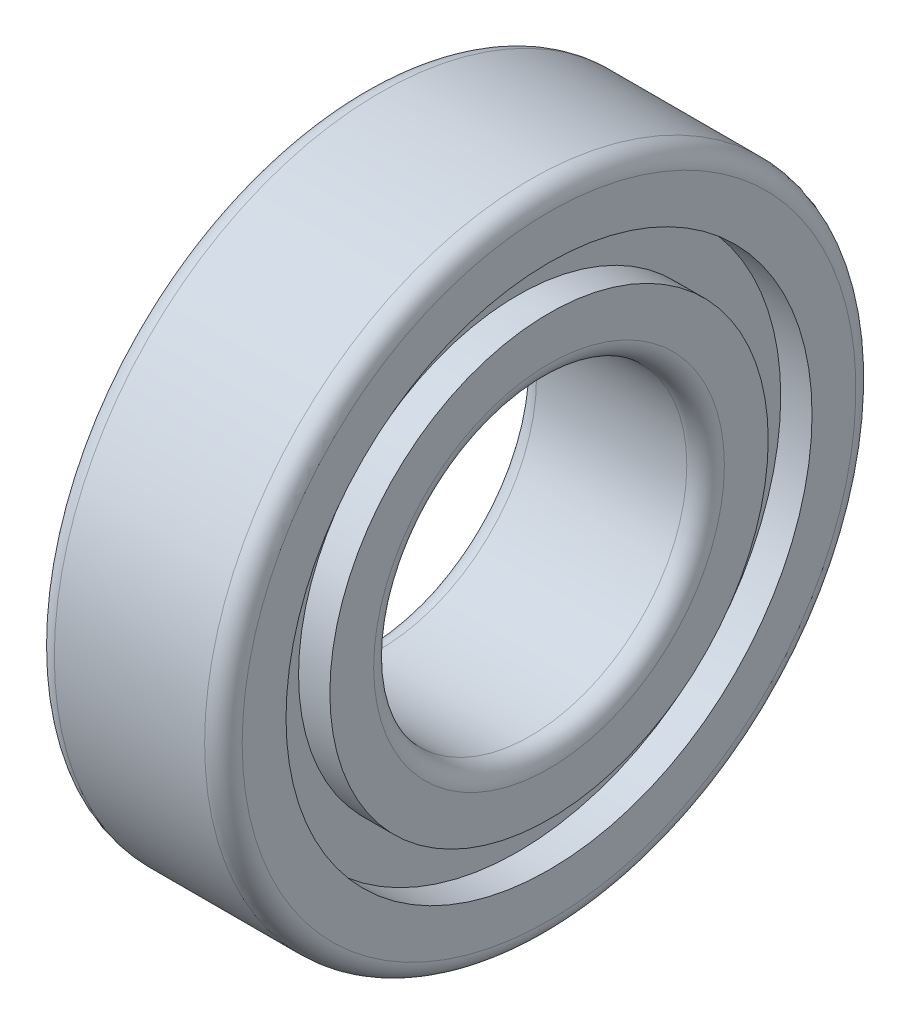
ISO-10303-21;
HEADER;
FILE_DESCRIPTION(('STEP AP214'),'2;1');
FILE_NAME('part.step','',(''),(''),'','','');
FILE_SCHEMA(('AUTOMOTIVE_DESIGN { 1 0 10303 214 1 1 1 1 }'));
ENDSEC;
DATA;
#1=APPLICATION_CONTEXT('core data for automotive mechanical design processes');
#2=APPLICATION_PROTOCOL_DEFINITION('international standard','automotive_design',2000,#1);
#3=PRODUCT_CONTEXT('',#1,'mechanical');
#4=PRODUCT('Part','Part','',(#3));
#5=PRODUCT_RELATED_PRODUCT_CATEGORY('part','',(#4));
#6=PRODUCT_DEFINITION_FORMATION('','',#4);
#7=PRODUCT_DEFINITION_CONTEXT('part definition',#1,'design');
#8=PRODUCT_DEFINITION('design','',#6,#7);
#9=PRODUCT_DEFINITION_SHAPE('','',#8);
#10=(LENGTH_UNIT() NAMED_UNIT(*) SI_UNIT(.MILLI.,.METRE.));
#11=(NAMED_UNIT(*) PLANE_ANGLE_UNIT() SI_UNIT($,.RADIAN.));
#12=(NAMED_UNIT(*) SI_UNIT($,.STERADIAN.) SOLID_ANGLE_UNIT());
#13=UNCERTAINTY_MEASURE_WITH_UNIT(LENGTH_MEASURE(1.E-05),#10,'distance_accuracy_value','');
#14=(GEOMETRIC_REPRESENTATION_CONTEXT(3) GLOBAL_UNCERTAINTY_ASSIGNED_CONTEXT((#13)) GLOBAL_UNIT_ASSIGNED_CONTEXT((#10,
#11,#12)) REPRESENTATION_CONTEXT('',''));
#15=CARTESIAN_POINT('',(0.,0.,0.));
#16=DIRECTION('',(0.,0.,1.));
#17=DIRECTION('',(1.,0.,0.));
#18=AXIS2_PLACEMENT_3D('',#15,#16,#17);
#19=CARTESIAN_POINT('',(-6.,0.,0.));
#20=DIRECTION('',(-1.,0.,0.));
#21=DIRECTION('',(0.,0.,1.));
#22=AXIS2_PLACEMENT_3D('',#19,#20,#21);
#23=TOROIDAL_SURFACE('',#22,14.,1.5);
#24=CARTESIAN_POINT('',(-6.00000000000001,0.,0.));
#25=DIRECTION('',(-1.,0.,0.));
#26=DIRECTION('',(0.,0.,1.));
#27=AXIS2_PLACEMENT_3D('',#24,#25,#26);
#28=CIRCLE('',#27,12.5);
#29=CARTESIAN_POINT('',(-6.00000000000001,0.,12.5));
#30=VERTEX_POINT('',#29);
#31=EDGE_CURVE('E85',#30,#30,#28,.T.);
#32=ORIENTED_EDGE('',*,*,#31,.F.);
#33=EDGE_LOOP('',(#32));
#34=FACE_BOUND('',#33,.T.);
#35=CARTESIAN_POINT('',(-7.49999999999995,0.,0.));
#36=DIRECTION('',(-1.,0.,0.));
#37=DIRECTION('',(0.,0.,1.));
#38=AXIS2_PLACEMENT_3D('',#35,#36,#37);
#39=CIRCLE('',#38,14.);
#40=CARTESIAN_POINT('',(-7.49999999999995,0.,14.));
#41=VERTEX_POINT('',#40);
#42=EDGE_CURVE('E10',#41,#41,#39,.T.);
#43=ORIENTED_EDGE('',*,*,#42,.T.);
#44=EDGE_LOOP('',(#43));
#45=FACE_BOUND('',#44,.T.);
#46=ADVANCED_FACE('F33',(#34,#45),#23,.T.);
#47=CARTESIAN_POINT('',(-7.5,14.,0.));
#48=DIRECTION('',(1.,0.,0.));
#49=DIRECTION('',(0.,0.,-1.));
#50=AXIS2_PLACEMENT_3D('',#47,#48,#49);
#51=PLANE('',#50);
#52=ORIENTED_EDGE('',*,*,#42,.F.);
#53=EDGE_LOOP('',(#52));
#54=FACE_BOUND('',#53,.T.);
#55=CARTESIAN_POINT('',(-7.49999999999995,0.,0.));
#56=DIRECTION('',(-1.,0.,0.));
#57=DIRECTION('',(0.,0.,1.));
#58=AXIS2_PLACEMENT_3D('',#55,#56,#57);
#59=CIRCLE('',#58,17.5);
#60=CARTESIAN_POINT('',(-7.49999999999995,0.,17.5));
#61=VERTEX_POINT('',#60);
#62=EDGE_CURVE('E39',#61,#61,#59,.T.);
#63=ORIENTED_EDGE('',*,*,#62,.T.);
#64=EDGE_LOOP('',(#63));
#65=FACE_BOUND('',#64,.T.);
#66=ADVANCED_FACE('F92',(#54,#65),#51,.F.);
#67=CARTESIAN_POINT('',(-1000.,0.,0.));
#68=DIRECTION('',(-1.,0.,0.));
#69=DIRECTION('',(0.,0.,1.));
#70=AXIS2_PLACEMENT_3D('',#67,#68,#69);
#71=CYLINDRICAL_SURFACE('',#70,17.5);
#72=ORIENTED_EDGE('',*,*,#62,.F.);
#73=EDGE_LOOP('',(#72));
#74=FACE_BOUND('',#73,.T.);
#75=CARTESIAN_POINT('',(-5.,0.,0.));
#76=DIRECTION('',(-1.,0.,0.));
#77=DIRECTION('',(0.,0.,1.));
#78=AXIS2_PLACEMENT_3D('',#75,#76,#77);
#79=CIRCLE('',#78,17.5);
#80=CARTESIAN_POINT('',(-5.,0.,17.5));
#81=VERTEX_POINT('',#80);
#82=EDGE_CURVE('E43',#81,#81,#79,.T.);
#83=ORIENTED_EDGE('',*,*,#82,.T.);
#84=EDGE_LOOP('',(#83));
#85=FACE_BOUND('',#84,.T.);
#86=ADVANCED_FACE('F96',(#74,#85),#71,.T.);
#87=CARTESIAN_POINT('',(-5.,17.5,0.));
#88=DIRECTION('',(1.,0.,0.));
#89=DIRECTION('',(0.,0.,-1.));
#90=AXIS2_PLACEMENT_3D('',#87,#88,#89);
#91=PLANE('',#90);
#92=ORIENTED_EDGE('',*,*,#82,.F.);
#93=EDGE_LOOP('',(#92));
#94=FACE_BOUND('',#93,.T.);
#95=CARTESIAN_POINT('',(-5.,0.,0.));
#96=DIRECTION('',(-1.,0.,0.));
#97=DIRECTION('',(0.,0.,1.));
#98=AXIS2_PLACEMENT_3D('',#95,#96,#97);
#99=CIRCLE('',#98,21.);
#100=CARTESIAN_POINT('',(-5.,0.,21.));
#101=VERTEX_POINT('',#100);
#102=EDGE_CURVE('E47',#101,#101,#99,.T.);
#103=ORIENTED_EDGE('',*,*,#102,.T.);
#104=EDGE_LOOP('',(#103));
#105=FACE_BOUND('',#104,.T.);
#106=ADVANCED_FACE('F101',(#94,#105),#91,.F.);
#107=CARTESIAN_POINT('',(-1000.,0.,0.));
#108=DIRECTION('',(-1.,0.,0.));
#109=DIRECTION('',(0.,0.,1.));
#110=AXIS2_PLACEMENT_3D('',#107,#108,#109);
#111=CYLINDRICAL_SURFACE('',#110,21.);
#112=ORIENTED_EDGE('',*,*,#102,.F.);
#113=EDGE_LOOP('',(#112));
#114=FACE_BOUND('',#113,.T.);
#115=CARTESIAN_POINT('',(-7.49999999999995,0.,0.));
#116=DIRECTION('',(-1.,0.,0.));
#117=DIRECTION('',(0.,0.,1.));
#118=AXIS2_PLACEMENT_3D('',#115,#116,#117);
#119=CIRCLE('',#118,21.);
#120=CARTESIAN_POINT('',(-7.49999999999995,0.,21.));
#121=VERTEX_POINT('',#120);
#122=EDGE_CURVE('E52',#121,#121,#119,.T.);
#123=ORIENTED_EDGE('',*,*,#122,.T.);
#124=EDGE_LOOP('',(#123));
#125=FACE_BOUND('',#124,.T.);
#126=ADVANCED_FACE('F107',(#114,#125),#111,.F.);
#127=CARTESIAN_POINT('',(-7.5,21.,0.));
#128=DIRECTION('',(1.,0.,0.));
#129=DIRECTION('',(0.,0.,-1.));
#130=AXIS2_PLACEMENT_3D('',#127,#128,#129);
#131=PLANE('',#130);
#132=ORIENTED_EDGE('',*,*,#122,.F.);
#133=EDGE_LOOP('',(#132));
#134=FACE_BOUND('',#133,.T.);
#135=CARTESIAN_POINT('',(-7.49999999999995,0.,0.));
#136=DIRECTION('',(-1.,0.,0.));
#137=DIRECTION('',(0.,0.,1.));
#138=AXIS2_PLACEMENT_3D('',#135,#136,#137);
#139=CIRCLE('',#138,24.5);
#140=CARTESIAN_POINT('',(-7.49999999999995,0.,24.5));
#141=VERTEX_POINT('',#140);
#142=EDGE_CURVE('E55',#141,#141,#139,.T.);
#143=ORIENTED_EDGE('',*,*,#142,.T.);
#144=EDGE_LOOP('',(#143));
#145=FACE_BOUND('',#144,.T.);
#146=ADVANCED_FACE('F111',(#134,#145),#131,.F.);
#147=CARTESIAN_POINT('',(-6.,0.,0.));
#148=DIRECTION('',(-1.,0.,0.));
#149=DIRECTION('',(0.,0.,1.));
#150=AXIS2_PLACEMENT_3D('',#147,#148,#149);
#151=TOROIDAL_SURFACE('',#150,24.5,1.5);
#152=ORIENTED_EDGE('',*,*,#142,.F.);
#153=EDGE_LOOP('',(#152));
#154=FACE_BOUND('',#153,.T.);
#155=CARTESIAN_POINT('',(-6.00000000000001,0.,0.));
#156=DIRECTION('',(-1.,0.,0.));
#157=DIRECTION('',(0.,0.,1.));
#158=AXIS2_PLACEMENT_3D('',#155,#156,#157);
#159=CIRCLE('',#158,26.);
#160=CARTESIAN_POINT('',(-6.00000000000001,0.,26.));
#161=VERTEX_POINT('',#160);
#162=EDGE_CURVE('E58',#161,#161,#159,.T.);
#163=ORIENTED_EDGE('',*,*,#162,.T.);
#164=EDGE_LOOP('',(#163));
#165=FACE_BOUND('',#164,.T.);
#166=ADVANCED_FACE('F115',(#154,#165),#151,.T.);
#167=CARTESIAN_POINT('',(-1000.,0.,0.));
#168=DIRECTION('',(-1.,0.,0.));
#169=DIRECTION('',(0.,0.,1.));
#170=AXIS2_PLACEMENT_3D('',#167,#168,#169);
#171=CYLINDRICAL_SURFACE('',#170,26.);
#172=ORIENTED_EDGE('',*,*,#162,.F.);
#173=EDGE_LOOP('',(#172));
#174=FACE_BOUND('',#173,.T.);
#175=CARTESIAN_POINT('',(6.00000000000001,0.,0.));
#176=DIRECTION('',(-1.,0.,0.));
#177=DIRECTION('',(0.,0.,1.));
#178=AXIS2_PLACEMENT_3D('',#175,#176,#177);
#179=CIRCLE('',#178,26.);
#180=CARTESIAN_POINT('',(6.00000000000001,0.,26.));
#181=VERTEX_POINT('',#180);
#182=EDGE_CURVE('E61',#181,#181,#179,.T.);
#183=ORIENTED_EDGE('',*,*,#182,.T.);
#184=EDGE_LOOP('',(#183));
#185=FACE_BOUND('',#184,.T.);
#186=ADVANCED_FACE('F119',(#174,#185),#171,.T.);
#187=CARTESIAN_POINT('',(6.,0.,0.));
#188=DIRECTION('',(-1.,0.,0.));
#189=DIRECTION('',(0.,0.,1.));
#190=AXIS2_PLACEMENT_3D('',#187,#188,#189);
#191=TOROIDAL_SURFACE('',#190,24.5,1.5);
#192=ORIENTED_EDGE('',*,*,#182,.F.);
#193=EDGE_LOOP('',(#192));
#194=FACE_BOUND('',#193,.T.);
#195=CARTESIAN_POINT('',(7.50000000000006,0.,0.));
#196=DIRECTION('',(-1.,0.,0.));
#197=DIRECTION('',(0.,0.,1.));
#198=AXIS2_PLACEMENT_3D('',#195,#196,#197);
#199=CIRCLE('',#198,24.5);
#200=CARTESIAN_POINT('',(7.50000000000006,0.,24.5));
#201=VERTEX_POINT('',#200);
#202=EDGE_CURVE('E64',#201,#201,#199,.T.);
#203=ORIENTED_EDGE('',*,*,#202,.T.);
#204=EDGE_LOOP('',(#203));
#205=FACE_BOUND('',#204,.T.);
#206=ADVANCED_FACE('F123',(#194,#205),#191,.T.);
#207=CARTESIAN_POINT('',(7.5,21.,0.));
#208=DIRECTION('',(-1.,0.,0.));
#209=DIRECTION('',(0.,0.,1.));
#210=AXIS2_PLACEMENT_3D('',#207,#208,#209);
#211=PLANE('',#210);
#212=ORIENTED_EDGE('',*,*,#202,.F.);
#213=EDGE_LOOP('',(#212));
#214=FACE_BOUND('',#213,.T.);
#215=CARTESIAN_POINT('',(7.50000000000006,0.,0.));
#216=DIRECTION('',(-1.,0.,0.));
#217=DIRECTION('',(0.,0.,1.));
#218=AXIS2_PLACEMENT_3D('',#215,#216,#217);
#219=CIRCLE('',#218,21.);
#220=CARTESIAN_POINT('',(7.50000000000006,0.,21.));
#221=VERTEX_POINT('',#220);
#222=EDGE_CURVE('E67',#221,#221,#219,.T.);
#223=ORIENTED_EDGE('',*,*,#222,.T.);
#224=EDGE_LOOP('',(#223));
#225=FACE_BOUND('',#224,.T.);
#226=ADVANCED_FACE('F127',(#214,#225),#211,.F.);
#227=CARTESIAN_POINT('',(-1000.,0.,0.));
#228=DIRECTION('',(-1.,0.,0.));
#229=DIRECTION('',(0.,0.,1.));
#230=AXIS2_PLACEMENT_3D('',#227,#228,#229);
#231=CYLINDRICAL_SURFACE('',#230,21.);
#232=ORIENTED_EDGE('',*,*,#222,.F.);
#233=EDGE_LOOP('',(#232));
#234=FACE_BOUND('',#233,.T.);
#235=CARTESIAN_POINT('',(4.99999999999989,0.,0.));
#236=DIRECTION('',(-1.,0.,0.));
#237=DIRECTION('',(0.,0.,1.));
#238=AXIS2_PLACEMENT_3D('',#235,#236,#237);
#239=CIRCLE('',#238,21.);
#240=CARTESIAN_POINT('',(4.99999999999989,0.,21.));
#241=VERTEX_POINT('',#240);
#242=EDGE_CURVE('E70',#241,#241,#239,.T.);
#243=ORIENTED_EDGE('',*,*,#242,.T.);
#244=EDGE_LOOP('',(#243));
#245=FACE_BOUND('',#244,.T.);
#246=ADVANCED_FACE('F131',(#234,#245),#231,.F.);
#247=CARTESIAN_POINT('',(5.,17.5,0.));
#248=DIRECTION('',(-1.,0.,0.));
#249=DIRECTION('',(0.,0.,1.));
#250=AXIS2_PLACEMENT_3D('',#247,#248,#249);
#251=PLANE('',#250);
#252=ORIENTED_EDGE('',*,*,#242,.F.);
#253=EDGE_LOOP('',(#252));
#254=FACE_BOUND('',#253,.T.);
#255=CARTESIAN_POINT('',(4.99999999999989,0.,0.));
#256=DIRECTION('',(-1.,0.,0.));
#257=DIRECTION('',(0.,0.,1.));
#258=AXIS2_PLACEMENT_3D('',#255,#256,#257);
#259=CIRCLE('',#258,17.5);
#260=CARTESIAN_POINT('',(4.99999999999989,0.,17.5));
#261=VERTEX_POINT('',#260);
#262=EDGE_CURVE('E73',#261,#261,#259,.T.);
#263=ORIENTED_EDGE('',*,*,#262,.T.);
#264=EDGE_LOOP('',(#263));
#265=FACE_BOUND('',#264,.T.);
#266=ADVANCED_FACE('F135',(#254,#265),#251,.F.);
#267=CARTESIAN_POINT('',(-1000.,0.,0.));
#268=DIRECTION('',(-1.,0.,0.));
#269=DIRECTION('',(0.,0.,1.));
#270=AXIS2_PLACEMENT_3D('',#267,#268,#269);
#271=CYLINDRICAL_SURFACE('',#270,17.5);
#272=ORIENTED_EDGE('',*,*,#262,.F.);
#273=EDGE_LOOP('',(#272));
#274=FACE_BOUND('',#273,.T.);
#275=CARTESIAN_POINT('',(7.50000000000006,0.,0.));
#276=DIRECTION('',(-1.,0.,0.));
#277=DIRECTION('',(0.,0.,1.));
#278=AXIS2_PLACEMENT_3D('',#275,#276,#277);
#279=CIRCLE('',#278,17.5);
#280=CARTESIAN_POINT('',(7.50000000000006,0.,17.5));
#281=VERTEX_POINT('',#280);
#282=EDGE_CURVE('E76',#281,#281,#279,.T.);
#283=ORIENTED_EDGE('',*,*,#282,.T.);
#284=EDGE_LOOP('',(#283));
#285=FACE_BOUND('',#284,.T.);
#286=ADVANCED_FACE('F139',(#274,#285),#271,.T.);
#287=CARTESIAN_POINT('',(7.5,14.,0.));
#288=DIRECTION('',(-1.,0.,0.));
#289=DIRECTION('',(0.,0.,1.));
#290=AXIS2_PLACEMENT_3D('',#287,#288,#289);
#291=PLANE('',#290);
#292=ORIENTED_EDGE('',*,*,#282,.F.);
#293=EDGE_LOOP('',(#292));
#294=FACE_BOUND('',#293,.T.);
#295=CARTESIAN_POINT('',(7.50000000000006,0.,0.));
#296=DIRECTION('',(-1.,0.,0.));
#297=DIRECTION('',(0.,0.,1.));
#298=AXIS2_PLACEMENT_3D('',#295,#296,#297);
#299=CIRCLE('',#298,14.);
#300=CARTESIAN_POINT('',(7.50000000000006,0.,14.));
#301=VERTEX_POINT('',#300);
#302=EDGE_CURVE('E79',#301,#301,#299,.T.);
#303=ORIENTED_EDGE('',*,*,#302,.T.);
#304=EDGE_LOOP('',(#303));
#305=FACE_BOUND('',#304,.T.);
#306=ADVANCED_FACE('F143',(#294,#305),#291,.F.);
#307=CARTESIAN_POINT('',(6.,0.,0.));
#308=DIRECTION('',(-1.,0.,0.));
#309=DIRECTION('',(0.,0.,1.));
#310=AXIS2_PLACEMENT_3D('',#307,#308,#309);
#311=TOROIDAL_SURFACE('',#310,14.,1.5);
#312=ORIENTED_EDGE('',*,*,#302,.F.);
#313=EDGE_LOOP('',(#312));
#314=FACE_BOUND('',#313,.T.);
#315=CARTESIAN_POINT('',(6.00000000000001,0.,0.));
#316=DIRECTION('',(-1.,0.,0.));
#317=DIRECTION('',(0.,0.,1.));
#318=AXIS2_PLACEMENT_3D('',#315,#316,#317);
#319=CIRCLE('',#318,12.5);
#320=CARTESIAN_POINT('',(6.00000000000001,0.,12.5));
#321=VERTEX_POINT('',#320);
#322=EDGE_CURVE('E82',#321,#321,#319,.T.);
#323=ORIENTED_EDGE('',*,*,#322,.T.);
#324=EDGE_LOOP('',(#323));
#325=FACE_BOUND('',#324,.T.);
#326=ADVANCED_FACE('F147',(#314,#325),#311,.T.);
#327=CARTESIAN_POINT('',(-1000.,0.,0.));
#328=DIRECTION('',(-1.,0.,0.));
#329=DIRECTION('',(0.,0.,1.));
#330=AXIS2_PLACEMENT_3D('',#327,#328,#329);
#331=CYLINDRICAL_SURFACE('',#330,12.5);
#332=ORIENTED_EDGE('',*,*,#322,.F.);
#333=EDGE_LOOP('',(#332));
#334=FACE_BOUND('',#333,.T.);
#335=ORIENTED_EDGE('',*,*,#31,.T.);
#336=EDGE_LOOP('',(#335));
#337=FACE_BOUND('',#336,.T.);
#338=ADVANCED_FACE('F89',(#334,#337),#331,.F.);
#339=CLOSED_SHELL('',(#46,#66,#86,#106,#126,#146,#166,#186,#206,#226,#246,#266,#286,#306,#326,#338));
#340=MANIFOLD_SOLID_BREP('B2',#339);
#341=ADVANCED_BREP_SHAPE_REPRESENTATION('',(#18,#340),#14);
#342=SHAPE_DEFINITION_REPRESENTATION(#9,#341);
ENDSEC;
END-ISO-10303-21;
